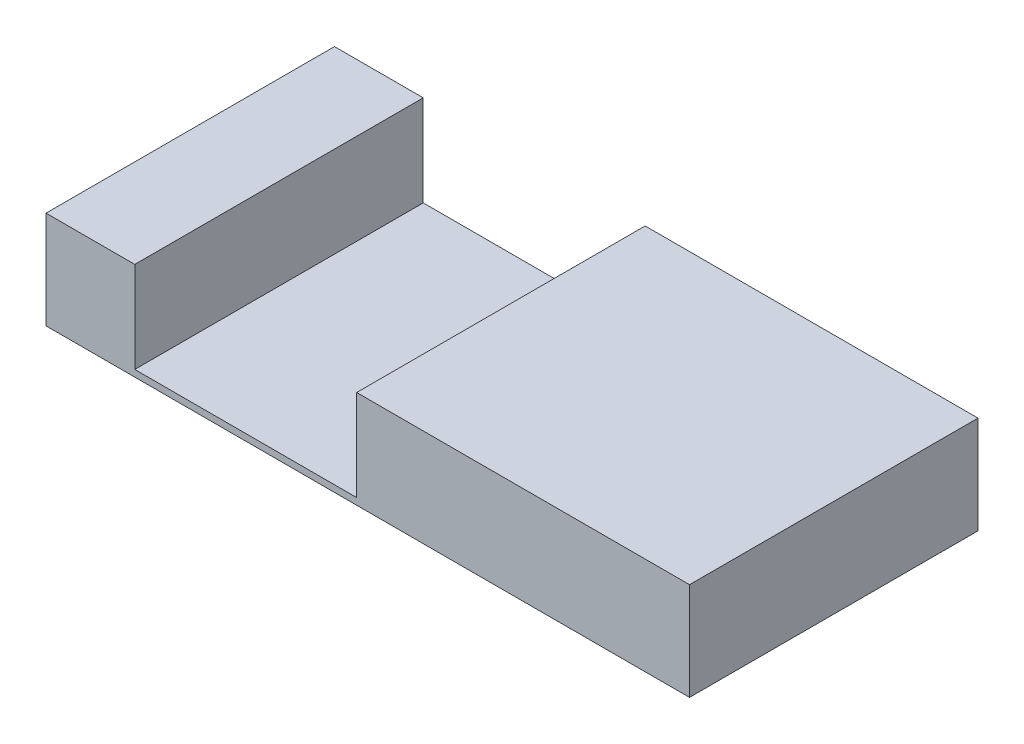
ISO-10303-21;
HEADER;
FILE_DESCRIPTION(('STEP AP214'),'2;1');
FILE_NAME('part.step','',(''),(''),'','','');
FILE_SCHEMA(('AUTOMOTIVE_DESIGN { 1 0 10303 214 1 1 1 1 }'));
ENDSEC;
DATA;
#1=APPLICATION_CONTEXT('core data for automotive mechanical design processes');
#2=APPLICATION_PROTOCOL_DEFINITION('international standard','automotive_design',2000,#1);
#3=PRODUCT_CONTEXT('',#1,'mechanical');
#4=PRODUCT('Part','Part','',(#3));
#5=PRODUCT_RELATED_PRODUCT_CATEGORY('part','',(#4));
#6=PRODUCT_DEFINITION_FORMATION('','',#4);
#7=PRODUCT_DEFINITION_CONTEXT('part definition',#1,'design');
#8=PRODUCT_DEFINITION('design','',#6,#7);
#9=PRODUCT_DEFINITION_SHAPE('','',#8);
#10=(LENGTH_UNIT() NAMED_UNIT(*) SI_UNIT(.MILLI.,.METRE.));
#11=(NAMED_UNIT(*) PLANE_ANGLE_UNIT() SI_UNIT($,.RADIAN.));
#12=(NAMED_UNIT(*) SI_UNIT($,.STERADIAN.) SOLID_ANGLE_UNIT());
#13=UNCERTAINTY_MEASURE_WITH_UNIT(LENGTH_MEASURE(1.E-05),#10,'distance_accuracy_value','');
#14=(GEOMETRIC_REPRESENTATION_CONTEXT(3) GLOBAL_UNCERTAINTY_ASSIGNED_CONTEXT((#13)) GLOBAL_UNIT_ASSIGNED_CONTEXT((#10,
#11,#12)) REPRESENTATION_CONTEXT('',''));
#15=CARTESIAN_POINT('',(0.,0.,0.));
#16=DIRECTION('',(0.,0.,1.));
#17=DIRECTION('',(1.,0.,0.));
#18=AXIS2_PLACEMENT_3D('',#15,#16,#17);
#19=CARTESIAN_POINT('',(0.,11.,0.));
#20=DIRECTION('',(0.,-1.,0.));
#21=DIRECTION('',(0.,0.,-1.));
#22=AXIS2_PLACEMENT_3D('',#19,#20,#21);
#23=PLANE('',#22);
#24=DIRECTION('',(-1.,0.,0.));
#25=VECTOR('',#24,1.);
#26=CARTESIAN_POINT('',(-72.5,11.,-32.5));
#27=LINE('',#26,#25);
#28=CARTESIAN_POINT('',(72.5,11.,-32.5));
#29=VERTEX_POINT('',#28);
#30=CARTESIAN_POINT('',(-2.49999999999996,11.,-32.5));
#31=VERTEX_POINT('',#30);
#32=EDGE_CURVE('E94',#29,#31,#27,.T.);
#33=ORIENTED_EDGE('',*,*,#32,.T.);
#34=DIRECTION('',(0.,0.,-1.));
#35=VECTOR('',#34,1.);
#36=CARTESIAN_POINT('',(-2.49999999999996,11.,32.5));
#37=LINE('',#36,#35);
#38=CARTESIAN_POINT('',(-2.49999999999996,11.,32.5));
#39=VERTEX_POINT('',#38);
#40=EDGE_CURVE('E132',#39,#31,#37,.T.);
#41=ORIENTED_EDGE('',*,*,#40,.F.);
#42=DIRECTION('',(1.,0.,0.));
#43=VECTOR('',#42,1.);
#44=CARTESIAN_POINT('',(-72.5,11.,32.5));
#45=LINE('',#44,#43);
#46=CARTESIAN_POINT('',(72.5,11.,32.5));
#47=VERTEX_POINT('',#46);
#48=EDGE_CURVE('E65',#39,#47,#45,.T.);
#49=ORIENTED_EDGE('',*,*,#48,.T.);
#50=DIRECTION('',(0.,0.,-1.));
#51=VECTOR('',#50,1.);
#52=CARTESIAN_POINT('',(72.5,11.,32.5));
#53=LINE('',#52,#51);
#54=EDGE_CURVE('E142',#47,#29,#53,.T.);
#55=ORIENTED_EDGE('',*,*,#54,.T.);
#56=EDGE_LOOP('',(#33,#41,#49,#55));
#57=FACE_BOUND('',#56,.T.);
#58=ADVANCED_FACE('F41',(#57),#23,.F.);
#59=CARTESIAN_POINT('',(72.5,11.,32.5));
#60=DIRECTION('',(-1.,0.,0.));
#61=DIRECTION('',(0.,0.,1.));
#62=AXIS2_PLACEMENT_3D('',#59,#60,#61);
#63=PLANE('',#62);
#64=DIRECTION('',(0.,0.,-1.));
#65=VECTOR('',#64,1.);
#66=CARTESIAN_POINT('',(72.5,-11.,32.5));
#67=LINE('',#66,#65);
#68=CARTESIAN_POINT('',(72.5,-11.,32.5));
#69=VERTEX_POINT('',#68);
#70=CARTESIAN_POINT('',(72.5,-11.,-32.5));
#71=VERTEX_POINT('',#70);
#72=EDGE_CURVE('E141',#69,#71,#67,.T.);
#73=ORIENTED_EDGE('',*,*,#72,.T.);
#74=DIRECTION('',(0.,-1.,0.));
#75=VECTOR('',#74,1.);
#76=CARTESIAN_POINT('',(72.5,11.,-32.5));
#77=LINE('',#76,#75);
#78=EDGE_CURVE('E12',#29,#71,#77,.T.);
#79=ORIENTED_EDGE('',*,*,#78,.F.);
#80=ORIENTED_EDGE('',*,*,#54,.F.);
#81=DIRECTION('',(0.,-1.,0.));
#82=VECTOR('',#81,1.);
#83=CARTESIAN_POINT('',(72.5,11.,32.5));
#84=LINE('',#83,#82);
#85=EDGE_CURVE('E151',#47,#69,#84,.T.);
#86=ORIENTED_EDGE('',*,*,#85,.T.);
#87=EDGE_LOOP('',(#73,#79,#80,#86));
#88=FACE_BOUND('',#87,.T.);
#89=ADVANCED_FACE('F43',(#88),#63,.F.);
#90=CARTESIAN_POINT('',(-72.5,11.,-32.5));
#91=DIRECTION('',(0.,0.,1.));
#92=DIRECTION('',(1.,0.,0.));
#93=AXIS2_PLACEMENT_3D('',#90,#91,#92);
#94=PLANE('',#93);
#95=DIRECTION('',(-1.,0.,0.));
#96=VECTOR('',#95,1.);
#97=CARTESIAN_POINT('',(-52.5,-9.49999999999999,-32.5));
#98=LINE('',#97,#96);
#99=CARTESIAN_POINT('',(-2.49999999999996,-9.49999999999999,-32.5));
#100=VERTEX_POINT('',#99);
#101=CARTESIAN_POINT('',(-52.5,-9.49999999999999,-32.5));
#102=VERTEX_POINT('',#101);
#103=EDGE_CURVE('E180',#100,#102,#98,.T.);
#104=ORIENTED_EDGE('',*,*,#103,.F.);
#105=DIRECTION('',(0.,1.,0.));
#106=VECTOR('',#105,1.);
#107=CARTESIAN_POINT('',(-2.49999999999996,-93.0060973342836,-32.5));
#108=LINE('',#107,#106);
#109=EDGE_CURVE('E121',#100,#31,#108,.T.);
#110=ORIENTED_EDGE('',*,*,#109,.T.);
#111=ORIENTED_EDGE('',*,*,#32,.F.);
#112=ORIENTED_EDGE('',*,*,#78,.T.);
#113=DIRECTION('',(-1.,0.,0.));
#114=VECTOR('',#113,1.);
#115=CARTESIAN_POINT('',(-72.5,-11.,-32.5));
#116=LINE('',#115,#114);
#117=CARTESIAN_POINT('',(-72.5,-11.,-32.5));
#118=VERTEX_POINT('',#117);
#119=EDGE_CURVE('E154',#71,#118,#116,.T.);
#120=ORIENTED_EDGE('',*,*,#119,.T.);
#121=DIRECTION('',(0.,-1.,0.));
#122=VECTOR('',#121,1.);
#123=CARTESIAN_POINT('',(-72.5,11.,-32.5));
#124=LINE('',#123,#122);
#125=CARTESIAN_POINT('',(-72.5,11.,-32.5));
#126=VERTEX_POINT('',#125);
#127=EDGE_CURVE('E49',#126,#118,#124,.T.);
#128=ORIENTED_EDGE('',*,*,#127,.F.);
#129=CARTESIAN_POINT('',(-52.5,11.,-32.5));
#130=VERTEX_POINT('',#129);
#131=EDGE_CURVE('E144',#130,#126,#27,.T.);
#132=ORIENTED_EDGE('',*,*,#131,.F.);
#133=DIRECTION('',(0.,1.,0.));
#134=VECTOR('',#133,1.);
#135=CARTESIAN_POINT('',(-52.5,-93.0060973342836,-32.5));
#136=LINE('',#135,#134);
#137=EDGE_CURVE('E56',#102,#130,#136,.T.);
#138=ORIENTED_EDGE('',*,*,#137,.F.);
#139=EDGE_LOOP('',(#104,#110,#111,#112,#120,#128,#132,#138));
#140=FACE_BOUND('',#139,.T.);
#141=ADVANCED_FACE('F181',(#140),#94,.F.);
#142=CARTESIAN_POINT('',(-72.5,11.,32.5));
#143=DIRECTION('',(1.,0.,0.));
#144=DIRECTION('',(0.,0.,-1.));
#145=AXIS2_PLACEMENT_3D('',#142,#143,#144);
#146=PLANE('',#145);
#147=DIRECTION('',(0.,0.,1.));
#148=VECTOR('',#147,1.);
#149=CARTESIAN_POINT('',(-72.5,-11.,32.5));
#150=LINE('',#149,#148);
#151=CARTESIAN_POINT('',(-72.5,-11.,32.5));
#152=VERTEX_POINT('',#151);
#153=EDGE_CURVE('E156',#118,#152,#150,.T.);
#154=ORIENTED_EDGE('',*,*,#153,.T.);
#155=DIRECTION('',(0.,-1.,0.));
#156=VECTOR('',#155,1.);
#157=CARTESIAN_POINT('',(-72.5,11.,32.5));
#158=LINE('',#157,#156);
#159=CARTESIAN_POINT('',(-72.5,11.,32.5));
#160=VERTEX_POINT('',#159);
#161=EDGE_CURVE('E160',#160,#152,#158,.T.);
#162=ORIENTED_EDGE('',*,*,#161,.F.);
#163=DIRECTION('',(0.,0.,1.));
#164=VECTOR('',#163,1.);
#165=CARTESIAN_POINT('',(-72.5,11.,32.5));
#166=LINE('',#165,#164);
#167=EDGE_CURVE('E146',#126,#160,#166,.T.);
#168=ORIENTED_EDGE('',*,*,#167,.F.);
#169=ORIENTED_EDGE('',*,*,#127,.T.);
#170=EDGE_LOOP('',(#154,#162,#168,#169));
#171=FACE_BOUND('',#170,.T.);
#172=ADVANCED_FACE('F166',(#171),#146,.F.);
#173=CARTESIAN_POINT('',(-72.5,11.,32.5));
#174=DIRECTION('',(0.,0.,-1.));
#175=DIRECTION('',(-1.,0.,0.));
#176=AXIS2_PLACEMENT_3D('',#173,#174,#175);
#177=PLANE('',#176);
#178=ORIENTED_EDGE('',*,*,#48,.F.);
#179=DIRECTION('',(0.,1.,0.));
#180=VECTOR('',#179,1.);
#181=CARTESIAN_POINT('',(-2.49999999999996,-93.0060973342836,32.5));
#182=LINE('',#181,#180);
#183=CARTESIAN_POINT('',(-2.49999999999996,-9.49999999999999,32.5));
#184=VERTEX_POINT('',#183);
#185=EDGE_CURVE('E120',#184,#39,#182,.T.);
#186=ORIENTED_EDGE('',*,*,#185,.F.);
#187=DIRECTION('',(1.,0.,0.));
#188=VECTOR('',#187,1.);
#189=CARTESIAN_POINT('',(-52.5,-9.49999999999999,32.5));
#190=LINE('',#189,#188);
#191=CARTESIAN_POINT('',(-52.5,-9.49999999999999,32.5));
#192=VERTEX_POINT('',#191);
#193=EDGE_CURVE('E127',#192,#184,#190,.T.);
#194=ORIENTED_EDGE('',*,*,#193,.F.);
#195=DIRECTION('',(0.,1.,0.));
#196=VECTOR('',#195,1.);
#197=CARTESIAN_POINT('',(-52.5,-93.0060973342836,32.5));
#198=LINE('',#197,#196);
#199=CARTESIAN_POINT('',(-52.5,11.,32.5));
#200=VERTEX_POINT('',#199);
#201=EDGE_CURVE('E139',#192,#200,#198,.T.);
#202=ORIENTED_EDGE('',*,*,#201,.T.);
#203=EDGE_CURVE('E148',#160,#200,#45,.T.);
#204=ORIENTED_EDGE('',*,*,#203,.F.);
#205=ORIENTED_EDGE('',*,*,#161,.T.);
#206=DIRECTION('',(1.,0.,0.));
#207=VECTOR('',#206,1.);
#208=CARTESIAN_POINT('',(-72.5,-11.,32.5));
#209=LINE('',#208,#207);
#210=EDGE_CURVE('E87',#152,#69,#209,.T.);
#211=ORIENTED_EDGE('',*,*,#210,.T.);
#212=ORIENTED_EDGE('',*,*,#85,.F.);
#213=EDGE_LOOP('',(#178,#186,#194,#202,#204,#205,#211,#212));
#214=FACE_BOUND('',#213,.T.);
#215=ADVANCED_FACE('F134',(#214),#177,.F.);
#216=ORIENTED_EDGE('',*,*,#203,.T.);
#217=DIRECTION('',(0.,0.,1.));
#218=VECTOR('',#217,1.);
#219=CARTESIAN_POINT('',(-52.5,11.,32.5));
#220=LINE('',#219,#218);
#221=EDGE_CURVE('E175',#130,#200,#220,.T.);
#222=ORIENTED_EDGE('',*,*,#221,.F.);
#223=ORIENTED_EDGE('',*,*,#131,.T.);
#224=ORIENTED_EDGE('',*,*,#167,.T.);
#225=EDGE_LOOP('',(#216,#222,#223,#224));
#226=FACE_BOUND('',#225,.T.);
#227=ADVANCED_FACE('F183',(#226),#23,.F.);
#228=CARTESIAN_POINT('',(0.,-11.,0.));
#229=DIRECTION('',(0.,-1.,0.));
#230=DIRECTION('',(0.,0.,-1.));
#231=AXIS2_PLACEMENT_3D('',#228,#229,#230);
#232=PLANE('',#231);
#233=ORIENTED_EDGE('',*,*,#72,.F.);
#234=ORIENTED_EDGE('',*,*,#210,.F.);
#235=ORIENTED_EDGE('',*,*,#153,.F.);
#236=ORIENTED_EDGE('',*,*,#119,.F.);
#237=EDGE_LOOP('',(#233,#234,#235,#236));
#238=FACE_BOUND('',#237,.T.);
#239=ADVANCED_FACE('F171',(#238),#232,.T.);
#240=CARTESIAN_POINT('',(0.,-9.5,0.));
#241=DIRECTION('',(0.,-1.,0.));
#242=DIRECTION('',(0.,0.,-1.));
#243=AXIS2_PLACEMENT_3D('',#240,#241,#242);
#244=PLANE('',#243);
#245=DIRECTION('',(0.,0.,1.));
#246=VECTOR('',#245,1.);
#247=CARTESIAN_POINT('',(-52.5,-9.49999999999999,32.5));
#248=LINE('',#247,#246);
#249=EDGE_CURVE('E129',#102,#192,#248,.T.);
#250=ORIENTED_EDGE('',*,*,#249,.T.);
#251=ORIENTED_EDGE('',*,*,#193,.T.);
#252=DIRECTION('',(0.,0.,-1.));
#253=VECTOR('',#252,1.);
#254=CARTESIAN_POINT('',(-2.49999999999996,-9.49999999999999,32.5));
#255=LINE('',#254,#253);
#256=EDGE_CURVE('E116',#184,#100,#255,.T.);
#257=ORIENTED_EDGE('',*,*,#256,.T.);
#258=ORIENTED_EDGE('',*,*,#103,.T.);
#259=EDGE_LOOP('',(#250,#251,#257,#258));
#260=FACE_BOUND('',#259,.T.);
#261=ADVANCED_FACE('F128',(#260),#244,.F.);
#262=CARTESIAN_POINT('',(-2.49999999999996,-93.0060973342836,32.5));
#263=DIRECTION('',(1.,0.,0.));
#264=DIRECTION('',(0.,0.,-1.));
#265=AXIS2_PLACEMENT_3D('',#262,#263,#264);
#266=PLANE('',#265);
#267=ORIENTED_EDGE('',*,*,#185,.T.);
#268=ORIENTED_EDGE('',*,*,#40,.T.);
#269=ORIENTED_EDGE('',*,*,#109,.F.);
#270=ORIENTED_EDGE('',*,*,#256,.F.);
#271=EDGE_LOOP('',(#267,#268,#269,#270));
#272=FACE_BOUND('',#271,.T.);
#273=ADVANCED_FACE('F118',(#272),#266,.F.);
#274=CARTESIAN_POINT('',(-52.5,-93.0060973342836,32.5));
#275=DIRECTION('',(-1.,0.,0.));
#276=DIRECTION('',(0.,0.,1.));
#277=AXIS2_PLACEMENT_3D('',#274,#275,#276);
#278=PLANE('',#277);
#279=ORIENTED_EDGE('',*,*,#137,.T.);
#280=ORIENTED_EDGE('',*,*,#221,.T.);
#281=ORIENTED_EDGE('',*,*,#201,.F.);
#282=ORIENTED_EDGE('',*,*,#249,.F.);
#283=EDGE_LOOP('',(#279,#280,#281,#282));
#284=FACE_BOUND('',#283,.T.);
#285=ADVANCED_FACE('F185',(#284),#278,.F.);
#286=CLOSED_SHELL('',(#58,#89,#141,#172,#215,#227,#239,#261,#273,#285));
#287=MANIFOLD_SOLID_BREP('B2',#286);
#288=ADVANCED_BREP_SHAPE_REPRESENTATION('',(#18,#287),#14);
#289=SHAPE_DEFINITION_REPRESENTATION(#9,#288);
ENDSEC;
END-ISO-10303-21;
